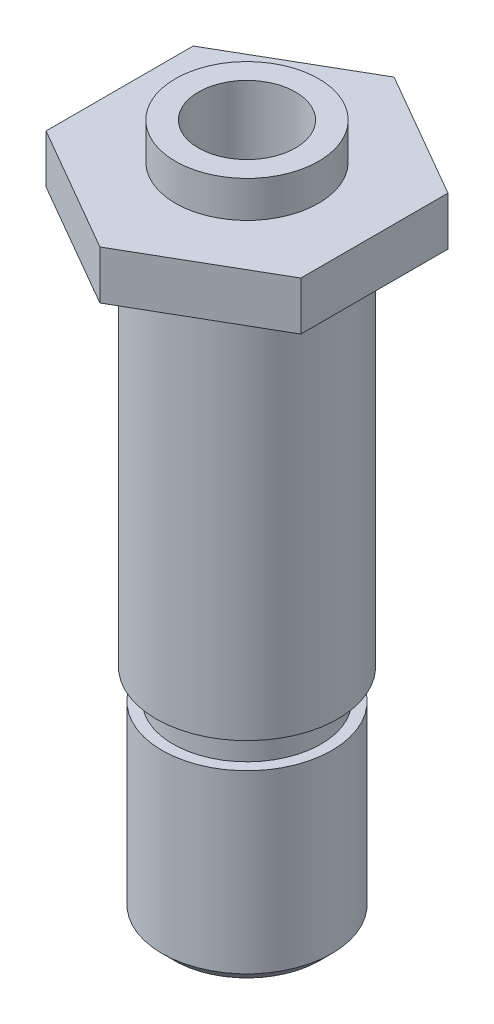
ISO-10303-21;
HEADER;
FILE_DESCRIPTION(('STEP AP214'),'2;1');
FILE_NAME('part.step','',(''),(''),'','','');
FILE_SCHEMA(('AUTOMOTIVE_DESIGN { 1 0 10303 214 1 1 1 1 }'));
ENDSEC;
DATA;
#1=APPLICATION_CONTEXT('core data for automotive mechanical design processes');
#2=APPLICATION_PROTOCOL_DEFINITION('international standard','automotive_design',2000,#1);
#3=PRODUCT_CONTEXT('',#1,'mechanical');
#4=PRODUCT('Part','Part','',(#3));
#5=PRODUCT_RELATED_PRODUCT_CATEGORY('part','',(#4));
#6=PRODUCT_DEFINITION_FORMATION('','',#4);
#7=PRODUCT_DEFINITION_CONTEXT('part definition',#1,'design');
#8=PRODUCT_DEFINITION('design','',#6,#7);
#9=PRODUCT_DEFINITION_SHAPE('','',#8);
#10=(LENGTH_UNIT() NAMED_UNIT(*) SI_UNIT(.MILLI.,.METRE.));
#11=(NAMED_UNIT(*) PLANE_ANGLE_UNIT() SI_UNIT($,.RADIAN.));
#12=(NAMED_UNIT(*) SI_UNIT($,.STERADIAN.) SOLID_ANGLE_UNIT());
#13=UNCERTAINTY_MEASURE_WITH_UNIT(LENGTH_MEASURE(1.E-05),#10,'distance_accuracy_value','');
#14=(GEOMETRIC_REPRESENTATION_CONTEXT(3) GLOBAL_UNCERTAINTY_ASSIGNED_CONTEXT((#13)) GLOBAL_UNIT_ASSIGNED_CONTEXT((#10,
#11,#12)) REPRESENTATION_CONTEXT('',''));
#15=CARTESIAN_POINT('',(0.,0.,0.));
#16=DIRECTION('',(0.,0.,1.));
#17=DIRECTION('',(1.,0.,0.));
#18=AXIS2_PLACEMENT_3D('',#15,#16,#17);
#19=CARTESIAN_POINT('',(0.,4.,12.1243556529823));
#20=DIRECTION('',(-0.5,0.,-0.866025403784439));
#21=DIRECTION('',(-0.866025403784439,0.,0.5));
#22=AXIS2_PLACEMENT_3D('',#19,#20,#21);
#23=PLANE('',#22);
#24=DIRECTION('',(0.866025403784439,0.,-0.5));
#25=VECTOR('',#24,1.);
#26=CARTESIAN_POINT('',(0.,0.,12.1243556529823));
#27=LINE('',#26,#25);
#28=CARTESIAN_POINT('',(0.,0.,12.1243556529823));
#29=VERTEX_POINT('',#28);
#30=CARTESIAN_POINT('',(10.5000000000001,0.,6.06217782649115));
#31=VERTEX_POINT('',#30);
#32=EDGE_CURVE('E120',#29,#31,#27,.T.);
#33=ORIENTED_EDGE('',*,*,#32,.T.);
#34=DIRECTION('',(0.,-1.,0.));
#35=VECTOR('',#34,1.);
#36=CARTESIAN_POINT('',(10.5000000000001,4.,6.06217782649115));
#37=LINE('',#36,#35);
#38=CARTESIAN_POINT('',(10.5000000000001,4.,6.06217782649115));
#39=VERTEX_POINT('',#38);
#40=EDGE_CURVE('E138',#39,#31,#37,.T.);
#41=ORIENTED_EDGE('',*,*,#40,.F.);
#42=DIRECTION('',(0.866025403784439,0.,-0.5));
#43=VECTOR('',#42,1.);
#44=CARTESIAN_POINT('',(0.,4.,12.1243556529823));
#45=LINE('',#44,#43);
#46=CARTESIAN_POINT('',(0.,4.,12.1243556529823));
#47=VERTEX_POINT('',#46);
#48=EDGE_CURVE('E131',#47,#39,#45,.T.);
#49=ORIENTED_EDGE('',*,*,#48,.F.);
#50=DIRECTION('',(0.,-1.,0.));
#51=VECTOR('',#50,1.);
#52=CARTESIAN_POINT('',(0.,4.,12.1243556529823));
#53=LINE('',#52,#51);
#54=EDGE_CURVE('E116',#47,#29,#53,.T.);
#55=ORIENTED_EDGE('',*,*,#54,.T.);
#56=EDGE_LOOP('',(#33,#41,#49,#55));
#57=FACE_BOUND('',#56,.T.);
#58=ADVANCED_FACE('F34',(#57),#23,.F.);
#59=CARTESIAN_POINT('',(10.5000000000001,4.,6.06217782649115));
#60=DIRECTION('',(-1.,0.,0.));
#61=DIRECTION('',(0.,0.,1.));
#62=AXIS2_PLACEMENT_3D('',#59,#60,#61);
#63=PLANE('',#62);
#64=DIRECTION('',(0.,0.,-1.));
#65=VECTOR('',#64,1.);
#66=CARTESIAN_POINT('',(10.5000000000001,0.,6.06217782649115));
#67=LINE('',#66,#65);
#68=CARTESIAN_POINT('',(10.5000000000001,0.,-6.06217782649115));
#69=VERTEX_POINT('',#68);
#70=EDGE_CURVE('E123',#31,#69,#67,.T.);
#71=ORIENTED_EDGE('',*,*,#70,.T.);
#72=DIRECTION('',(0.,-1.,0.));
#73=VECTOR('',#72,1.);
#74=CARTESIAN_POINT('',(10.5000000000001,4.,-6.06217782649115));
#75=LINE('',#74,#73);
#76=CARTESIAN_POINT('',(10.5000000000001,4.,-6.06217782649115));
#77=VERTEX_POINT('',#76);
#78=EDGE_CURVE('E135',#77,#69,#75,.T.);
#79=ORIENTED_EDGE('',*,*,#78,.F.);
#80=DIRECTION('',(0.,0.,-1.));
#81=VECTOR('',#80,1.);
#82=CARTESIAN_POINT('',(10.5000000000001,4.,6.06217782649115));
#83=LINE('',#82,#81);
#84=EDGE_CURVE('E89',#39,#77,#83,.T.);
#85=ORIENTED_EDGE('',*,*,#84,.F.);
#86=ORIENTED_EDGE('',*,*,#40,.T.);
#87=EDGE_LOOP('',(#71,#79,#85,#86));
#88=FACE_BOUND('',#87,.T.);
#89=ADVANCED_FACE('F160',(#88),#63,.F.);
#90=CARTESIAN_POINT('',(10.5000000000001,4.,-6.06217782649115));
#91=DIRECTION('',(-0.5,0.,0.866025403784439));
#92=DIRECTION('',(0.866025403784439,0.,0.5));
#93=AXIS2_PLACEMENT_3D('',#90,#91,#92);
#94=PLANE('',#93);
#95=DIRECTION('',(-0.866025403784439,0.,-0.5));
#96=VECTOR('',#95,1.);
#97=CARTESIAN_POINT('',(10.5000000000001,0.,-6.06217782649115));
#98=LINE('',#97,#96);
#99=CARTESIAN_POINT('',(0.,0.,-12.1243556529823));
#100=VERTEX_POINT('',#99);
#101=EDGE_CURVE('E126',#69,#100,#98,.T.);
#102=ORIENTED_EDGE('',*,*,#101,.T.);
#103=DIRECTION('',(0.,-1.,0.));
#104=VECTOR('',#103,1.);
#105=CARTESIAN_POINT('',(0.,4.,-12.1243556529823));
#106=LINE('',#105,#104);
#107=CARTESIAN_POINT('',(0.,4.,-12.1243556529823));
#108=VERTEX_POINT('',#107);
#109=EDGE_CURVE('E111',#108,#100,#106,.T.);
#110=ORIENTED_EDGE('',*,*,#109,.F.);
#111=DIRECTION('',(-0.866025403784439,0.,-0.5));
#112=VECTOR('',#111,1.);
#113=CARTESIAN_POINT('',(10.5000000000001,4.,-6.06217782649115));
#114=LINE('',#113,#112);
#115=EDGE_CURVE('E102',#77,#108,#114,.T.);
#116=ORIENTED_EDGE('',*,*,#115,.F.);
#117=ORIENTED_EDGE('',*,*,#78,.T.);
#118=EDGE_LOOP('',(#102,#110,#116,#117));
#119=FACE_BOUND('',#118,.T.);
#120=ADVANCED_FACE('F163',(#119),#94,.F.);
#121=CARTESIAN_POINT('',(0.,4.,-12.1243556529823));
#122=DIRECTION('',(0.5,0.,0.866025403784439));
#123=DIRECTION('',(0.866025403784439,0.,-0.5));
#124=AXIS2_PLACEMENT_3D('',#121,#122,#123);
#125=PLANE('',#124);
#126=DIRECTION('',(-0.866025403784439,0.,0.5));
#127=VECTOR('',#126,1.);
#128=CARTESIAN_POINT('',(0.,0.,-12.1243556529823));
#129=LINE('',#128,#127);
#130=CARTESIAN_POINT('',(-10.5000000000001,0.,-6.06217782649115));
#131=VERTEX_POINT('',#130);
#132=EDGE_CURVE('E110',#100,#131,#129,.T.);
#133=ORIENTED_EDGE('',*,*,#132,.T.);
#134=DIRECTION('',(0.,-1.,0.));
#135=VECTOR('',#134,1.);
#136=CARTESIAN_POINT('',(-10.5000000000001,4.,-6.06217782649115));
#137=LINE('',#136,#135);
#138=CARTESIAN_POINT('',(-10.5000000000001,4.,-6.06217782649115));
#139=VERTEX_POINT('',#138);
#140=EDGE_CURVE('E107',#139,#131,#137,.T.);
#141=ORIENTED_EDGE('',*,*,#140,.F.);
#142=DIRECTION('',(-0.866025403784439,0.,0.5));
#143=VECTOR('',#142,1.);
#144=CARTESIAN_POINT('',(0.,4.,-12.1243556529823));
#145=LINE('',#144,#143);
#146=EDGE_CURVE('E96',#108,#139,#145,.T.);
#147=ORIENTED_EDGE('',*,*,#146,.F.);
#148=ORIENTED_EDGE('',*,*,#109,.T.);
#149=EDGE_LOOP('',(#133,#141,#147,#148));
#150=FACE_BOUND('',#149,.T.);
#151=ADVANCED_FACE('F108',(#150),#125,.F.);
#152=CARTESIAN_POINT('',(-10.5000000000001,4.,-6.06217782649115));
#153=DIRECTION('',(1.,0.,0.));
#154=DIRECTION('',(0.,0.,-1.));
#155=AXIS2_PLACEMENT_3D('',#152,#153,#154);
#156=PLANE('',#155);
#157=DIRECTION('',(0.,0.,1.));
#158=VECTOR('',#157,1.);
#159=CARTESIAN_POINT('',(-10.5000000000001,0.,-6.06217782649115));
#160=LINE('',#159,#158);
#161=CARTESIAN_POINT('',(-10.5000000000001,0.,6.06217782649115));
#162=VERTEX_POINT('',#161);
#163=EDGE_CURVE('E74',#131,#162,#160,.T.);
#164=ORIENTED_EDGE('',*,*,#163,.T.);
#165=DIRECTION('',(0.,-1.,0.));
#166=VECTOR('',#165,1.);
#167=CARTESIAN_POINT('',(-10.5000000000001,4.,6.06217782649115));
#168=LINE('',#167,#166);
#169=CARTESIAN_POINT('',(-10.5000000000001,4.,6.06217782649115));
#170=VERTEX_POINT('',#169);
#171=EDGE_CURVE('E112',#170,#162,#168,.T.);
#172=ORIENTED_EDGE('',*,*,#171,.F.);
#173=DIRECTION('',(0.,0.,1.));
#174=VECTOR('',#173,1.);
#175=CARTESIAN_POINT('',(-10.5000000000001,4.,-6.06217782649115));
#176=LINE('',#175,#174);
#177=EDGE_CURVE('E100',#139,#170,#176,.T.);
#178=ORIENTED_EDGE('',*,*,#177,.F.);
#179=ORIENTED_EDGE('',*,*,#140,.T.);
#180=EDGE_LOOP('',(#164,#172,#178,#179));
#181=FACE_BOUND('',#180,.T.);
#182=ADVANCED_FACE('F114',(#181),#156,.F.);
#183=CARTESIAN_POINT('',(-10.5000000000001,4.,6.06217782649115));
#184=DIRECTION('',(0.5,0.,-0.866025403784439));
#185=DIRECTION('',(-0.866025403784439,0.,-0.5));
#186=AXIS2_PLACEMENT_3D('',#183,#184,#185);
#187=PLANE('',#186);
#188=DIRECTION('',(0.866025403784439,0.,0.5));
#189=VECTOR('',#188,1.);
#190=CARTESIAN_POINT('',(-10.5000000000001,0.,6.06217782649115));
#191=LINE('',#190,#189);
#192=EDGE_CURVE('E80',#162,#29,#191,.T.);
#193=ORIENTED_EDGE('',*,*,#192,.T.);
#194=ORIENTED_EDGE('',*,*,#54,.F.);
#195=DIRECTION('',(0.866025403784439,0.,0.5));
#196=VECTOR('',#195,1.);
#197=CARTESIAN_POINT('',(-10.5000000000001,4.,6.06217782649115));
#198=LINE('',#197,#196);
#199=EDGE_CURVE('E51',#170,#47,#198,.T.);
#200=ORIENTED_EDGE('',*,*,#199,.F.);
#201=ORIENTED_EDGE('',*,*,#171,.T.);
#202=EDGE_LOOP('',(#193,#194,#200,#201));
#203=FACE_BOUND('',#202,.T.);
#204=ADVANCED_FACE('F168',(#203),#187,.F.);
#205=CARTESIAN_POINT('',(0.,4.,0.));
#206=DIRECTION('',(0.,1.,0.));
#207=DIRECTION('',(0.,0.,1.));
#208=AXIS2_PLACEMENT_3D('',#205,#206,#207);
#209=PLANE('',#208);
#210=CARTESIAN_POINT('',(0.,4.,0.));
#211=DIRECTION('',(0.,1.,0.));
#212=DIRECTION('',(0.,0.,1.));
#213=AXIS2_PLACEMENT_3D('',#210,#211,#212);
#214=CIRCLE('',#213,5.9);
#215=CARTESIAN_POINT('',(0.,4.,5.9));
#216=VERTEX_POINT('',#215);
#217=EDGE_CURVE('E139',#216,#216,#214,.T.);
#218=ORIENTED_EDGE('',*,*,#217,.F.);
#219=EDGE_LOOP('',(#218));
#220=FACE_BOUND('',#219,.T.);
#221=ORIENTED_EDGE('',*,*,#48,.T.);
#222=ORIENTED_EDGE('',*,*,#84,.T.);
#223=ORIENTED_EDGE('',*,*,#115,.T.);
#224=ORIENTED_EDGE('',*,*,#146,.T.);
#225=ORIENTED_EDGE('',*,*,#177,.T.);
#226=ORIENTED_EDGE('',*,*,#199,.T.);
#227=EDGE_LOOP('',(#221,#222,#223,#224,#225,#226));
#228=FACE_BOUND('',#227,.T.);
#229=ADVANCED_FACE('F98',(#220,#228),#209,.T.);
#230=CARTESIAN_POINT('',(0.,0.,0.));
#231=DIRECTION('',(0.,1.,0.));
#232=DIRECTION('',(0.,0.,1.));
#233=AXIS2_PLACEMENT_3D('',#230,#231,#232);
#234=PLANE('',#233);
#235=CARTESIAN_POINT('',(0.,0.,0.));
#236=DIRECTION('',(0.,-1.,0.));
#237=DIRECTION('',(0.,0.,-1.));
#238=AXIS2_PLACEMENT_3D('',#235,#236,#237);
#239=CIRCLE('',#238,7.5);
#240=CARTESIAN_POINT('',(0.,0.,-7.5));
#241=VERTEX_POINT('',#240);
#242=EDGE_CURVE('E141',#241,#241,#239,.T.);
#243=ORIENTED_EDGE('',*,*,#242,.F.);
#244=EDGE_LOOP('',(#243));
#245=FACE_BOUND('',#244,.T.);
#246=ORIENTED_EDGE('',*,*,#32,.F.);
#247=ORIENTED_EDGE('',*,*,#192,.F.);
#248=ORIENTED_EDGE('',*,*,#163,.F.);
#249=ORIENTED_EDGE('',*,*,#132,.F.);
#250=ORIENTED_EDGE('',*,*,#101,.F.);
#251=ORIENTED_EDGE('',*,*,#70,.F.);
#252=EDGE_LOOP('',(#246,#247,#248,#249,#250,#251));
#253=FACE_BOUND('',#252,.T.);
#254=ADVANCED_FACE('F166',(#245,#253),#234,.F.);
#255=CARTESIAN_POINT('',(0.,7.,0.));
#256=DIRECTION('',(0.,-1.,0.));
#257=DIRECTION('',(0.,0.,-1.));
#258=AXIS2_PLACEMENT_3D('',#255,#256,#257);
#259=CYLINDRICAL_SURFACE('',#258,5.9);
#260=CARTESIAN_POINT('',(0.,7.,0.));
#261=DIRECTION('',(0.,1.,0.));
#262=DIRECTION('',(0.,0.,1.));
#263=AXIS2_PLACEMENT_3D('',#260,#261,#262);
#264=CIRCLE('',#263,5.9);
#265=CARTESIAN_POINT('',(0.,7.,5.9));
#266=VERTEX_POINT('',#265);
#267=EDGE_CURVE('E124',#266,#266,#264,.T.);
#268=ORIENTED_EDGE('',*,*,#267,.F.);
#269=EDGE_LOOP('',(#268));
#270=FACE_BOUND('',#269,.T.);
#271=ORIENTED_EDGE('',*,*,#217,.T.);
#272=EDGE_LOOP('',(#271));
#273=FACE_BOUND('',#272,.T.);
#274=ADVANCED_FACE('F213',(#270,#273),#259,.T.);
#275=CARTESIAN_POINT('',(0.,7.,0.));
#276=DIRECTION('',(0.,1.,0.));
#277=DIRECTION('',(0.,0.,1.));
#278=AXIS2_PLACEMENT_3D('',#275,#276,#277);
#279=PLANE('',#278);
#280=CARTESIAN_POINT('',(0.,7.,0.));
#281=DIRECTION('',(0.,1.,0.));
#282=DIRECTION('',(0.,0.,1.));
#283=AXIS2_PLACEMENT_3D('',#280,#281,#282);
#284=CIRCLE('',#283,4.);
#285=CARTESIAN_POINT('',(0.,7.,4.));
#286=VERTEX_POINT('',#285);
#287=EDGE_CURVE('E152',#286,#286,#284,.T.);
#288=ORIENTED_EDGE('',*,*,#287,.F.);
#289=EDGE_LOOP('',(#288));
#290=FACE_BOUND('',#289,.T.);
#291=ORIENTED_EDGE('',*,*,#267,.T.);
#292=EDGE_LOOP('',(#291));
#293=FACE_BOUND('',#292,.T.);
#294=ADVANCED_FACE('F218',(#290,#293),#279,.T.);
#295=CARTESIAN_POINT('',(0.,-50.,0.));
#296=DIRECTION('',(0.,1.,0.));
#297=DIRECTION('',(0.,0.,1.));
#298=AXIS2_PLACEMENT_3D('',#295,#296,#297);
#299=CYLINDRICAL_SURFACE('',#298,7.5);
#300=CARTESIAN_POINT('',(0.,-32.,0.));
#301=DIRECTION('',(0.,-1.,0.));
#302=DIRECTION('',(0.,0.,-1.));
#303=AXIS2_PLACEMENT_3D('',#300,#301,#302);
#304=CIRCLE('',#303,7.5);
#305=CARTESIAN_POINT('',(0.,-32.,-7.5));
#306=VERTEX_POINT('',#305);
#307=EDGE_CURVE('E354',#306,#306,#304,.T.);
#308=ORIENTED_EDGE('',*,*,#307,.F.);
#309=EDGE_LOOP('',(#308));
#310=FACE_BOUND('',#309,.T.);
#311=ORIENTED_EDGE('',*,*,#242,.T.);
#312=EDGE_LOOP('',(#311));
#313=FACE_BOUND('',#312,.T.);
#314=ADVANCED_FACE('F234',(#310,#313),#299,.T.);
#315=CARTESIAN_POINT('',(0.,-28.,0.));
#316=DIRECTION('',(0.,1.,0.));
#317=DIRECTION('',(0.,0.,1.));
#318=AXIS2_PLACEMENT_3D('',#315,#316,#317);
#319=CYLINDRICAL_SURFACE('',#318,4.);
#320=CARTESIAN_POINT('',(0.,-28.,0.));
#321=DIRECTION('',(0.,1.,0.));
#322=DIRECTION('',(0.,0.,1.));
#323=AXIS2_PLACEMENT_3D('',#320,#321,#322);
#324=CIRCLE('',#323,4.);
#325=CARTESIAN_POINT('',(0.,-28.,4.));
#326=VERTEX_POINT('',#325);
#327=EDGE_CURVE('E155',#326,#326,#324,.T.);
#328=ORIENTED_EDGE('',*,*,#327,.F.);
#329=EDGE_LOOP('',(#328));
#330=FACE_BOUND('',#329,.T.);
#331=ORIENTED_EDGE('',*,*,#287,.T.);
#332=EDGE_LOOP('',(#331));
#333=FACE_BOUND('',#332,.T.);
#334=ADVANCED_FACE('F242',(#330,#333),#319,.F.);
#335=CARTESIAN_POINT('',(0.,-28.,0.));
#336=DIRECTION('',(0.,1.,0.));
#337=DIRECTION('',(0.,0.,1.));
#338=AXIS2_PLACEMENT_3D('',#335,#336,#337);
#339=PLANE('',#338);
#340=CARTESIAN_POINT('',(0.,-28.,0.));
#341=DIRECTION('',(0.,1.,0.));
#342=DIRECTION('',(0.,0.,1.));
#343=AXIS2_PLACEMENT_3D('',#340,#341,#342);
#344=CIRCLE('',#343,2.);
#345=CARTESIAN_POINT('',(0.,-28.,2.));
#346=VERTEX_POINT('',#345);
#347=EDGE_CURVE('E342',#346,#346,#344,.T.);
#348=ORIENTED_EDGE('',*,*,#347,.F.);
#349=EDGE_LOOP('',(#348));
#350=FACE_BOUND('',#349,.T.);
#351=ORIENTED_EDGE('',*,*,#327,.T.);
#352=EDGE_LOOP('',(#351));
#353=FACE_BOUND('',#352,.T.);
#354=ADVANCED_FACE('F247',(#350,#353),#339,.T.);
#355=CARTESIAN_POINT('',(0.,-32.,-7.5));
#356=DIRECTION('',(0.,1.,0.));
#357=DIRECTION('',(0.,0.,1.));
#358=AXIS2_PLACEMENT_3D('',#355,#356,#357);
#359=PLANE('',#358);
#360=CARTESIAN_POINT('',(0.,-32.,0.));
#361=DIRECTION('',(0.,-1.,0.));
#362=DIRECTION('',(0.,0.,-1.));
#363=AXIS2_PLACEMENT_3D('',#360,#361,#362);
#364=CIRCLE('',#363,6.1);
#365=CARTESIAN_POINT('',(0.,-32.,-6.1));
#366=VERTEX_POINT('',#365);
#367=EDGE_CURVE('E345',#366,#366,#364,.T.);
#368=ORIENTED_EDGE('',*,*,#367,.F.);
#369=EDGE_LOOP('',(#368));
#370=FACE_BOUND('',#369,.T.);
#371=ORIENTED_EDGE('',*,*,#307,.T.);
#372=EDGE_LOOP('',(#371));
#373=FACE_BOUND('',#372,.T.);
#374=ADVANCED_FACE('F262',(#370,#373),#359,.F.);
#375=CARTESIAN_POINT('',(0.,-50.5264897013956,0.));
#376=DIRECTION('',(0.,-1.,0.));
#377=DIRECTION('',(0.,0.,-1.));
#378=AXIS2_PLACEMENT_3D('',#375,#376,#377);
#379=CYLINDRICAL_SURFACE('',#378,6.1);
#380=CARTESIAN_POINT('',(0.,-34.5,0.));
#381=DIRECTION('',(0.,-1.,0.));
#382=DIRECTION('',(0.,0.,-1.));
#383=AXIS2_PLACEMENT_3D('',#380,#381,#382);
#384=CIRCLE('',#383,6.1);
#385=CARTESIAN_POINT('',(0.,-34.5,-6.1));
#386=VERTEX_POINT('',#385);
#387=EDGE_CURVE('E341',#386,#386,#384,.T.);
#388=ORIENTED_EDGE('',*,*,#387,.F.);
#389=EDGE_LOOP('',(#388));
#390=FACE_BOUND('',#389,.T.);
#391=ORIENTED_EDGE('',*,*,#367,.T.);
#392=EDGE_LOOP('',(#391));
#393=FACE_BOUND('',#392,.T.);
#394=ADVANCED_FACE('F267',(#390,#393),#379,.T.);
#395=CARTESIAN_POINT('',(0.,-34.5,-6.1));
#396=DIRECTION('',(0.,-1.,0.));
#397=DIRECTION('',(0.,0.,-1.));
#398=AXIS2_PLACEMENT_3D('',#395,#396,#397);
#399=PLANE('',#398);
#400=CARTESIAN_POINT('',(0.,-34.5,0.));
#401=DIRECTION('',(0.,-1.,0.));
#402=DIRECTION('',(0.,0.,-1.));
#403=AXIS2_PLACEMENT_3D('',#400,#401,#402);
#404=CIRCLE('',#403,7.);
#405=CARTESIAN_POINT('',(0.,-34.5,-7.));
#406=VERTEX_POINT('',#405);
#407=EDGE_CURVE('E340',#406,#406,#404,.T.);
#408=ORIENTED_EDGE('',*,*,#407,.F.);
#409=EDGE_LOOP('',(#408));
#410=FACE_BOUND('',#409,.T.);
#411=ORIENTED_EDGE('',*,*,#387,.T.);
#412=EDGE_LOOP('',(#411));
#413=FACE_BOUND('',#412,.T.);
#414=ADVANCED_FACE('F278',(#410,#413),#399,.F.);
#415=CARTESIAN_POINT('',(0.,-50.5264897013956,0.));
#416=DIRECTION('',(0.,-1.,0.));
#417=DIRECTION('',(0.,0.,-1.));
#418=AXIS2_PLACEMENT_3D('',#415,#416,#417);
#419=CYLINDRICAL_SURFACE('',#418,7.);
#420=CARTESIAN_POINT('',(0.,-49.,0.));
#421=DIRECTION('',(0.,-1.,0.));
#422=DIRECTION('',(0.,0.,-1.));
#423=AXIS2_PLACEMENT_3D('',#420,#421,#422);
#424=CIRCLE('',#423,7.);
#425=CARTESIAN_POINT('',(0.,-49.,-7.));
#426=VERTEX_POINT('',#425);
#427=EDGE_CURVE('E11',#426,#426,#424,.F.);
#428=ORIENTED_EDGE('',*,*,#427,.T.);
#429=EDGE_LOOP('',(#428));
#430=FACE_BOUND('',#429,.T.);
#431=ORIENTED_EDGE('',*,*,#407,.T.);
#432=EDGE_LOOP('',(#431));
#433=FACE_BOUND('',#432,.T.);
#434=ADVANCED_FACE('F288',(#430,#433),#419,.T.);
#435=CARTESIAN_POINT('',(0.,-50.,0.));
#436=DIRECTION('',(0.,-1.,0.));
#437=DIRECTION('',(0.,0.,-1.));
#438=AXIS2_PLACEMENT_3D('',#435,#436,#437);
#439=PLANE('',#438);
#440=CARTESIAN_POINT('',(0.,-50.,0.));
#441=DIRECTION('',(0.,-1.,0.));
#442=DIRECTION('',(0.,0.,-1.));
#443=AXIS2_PLACEMENT_3D('',#440,#441,#442);
#444=CIRCLE('',#443,6.00000000000002);
#445=CARTESIAN_POINT('',(0.,-50.,-6.00000000000002));
#446=VERTEX_POINT('',#445);
#447=EDGE_CURVE('E43',#446,#446,#444,.T.);
#448=ORIENTED_EDGE('',*,*,#447,.T.);
#449=EDGE_LOOP('',(#448));
#450=FACE_BOUND('',#449,.T.);
#451=CARTESIAN_POINT('',(0.,-50.,0.));
#452=DIRECTION('',(0.,-1.,0.));
#453=DIRECTION('',(0.,0.,-1.));
#454=AXIS2_PLACEMENT_3D('',#451,#452,#453);
#455=CIRCLE('',#454,2.);
#456=CARTESIAN_POINT('',(0.,-50.,-2.));
#457=VERTEX_POINT('',#456);
#458=EDGE_CURVE('E348',#457,#457,#455,.T.);
#459=ORIENTED_EDGE('',*,*,#458,.F.);
#460=EDGE_LOOP('',(#459));
#461=FACE_BOUND('',#460,.T.);
#462=ADVANCED_FACE('F308',(#450,#461),#439,.T.);
#463=CARTESIAN_POINT('',(0.,7.,0.));
#464=DIRECTION('',(0.,-1.,0.));
#465=DIRECTION('',(0.,0.,-1.));
#466=AXIS2_PLACEMENT_3D('',#463,#464,#465);
#467=CYLINDRICAL_SURFACE('',#466,2.);
#468=ORIENTED_EDGE('',*,*,#347,.T.);
#469=EDGE_LOOP('',(#468));
#470=FACE_BOUND('',#469,.T.);
#471=ORIENTED_EDGE('',*,*,#458,.T.);
#472=EDGE_LOOP('',(#471));
#473=FACE_BOUND('',#472,.T.);
#474=ADVANCED_FACE('F303',(#470,#473),#467,.F.);
#475=CARTESIAN_POINT('',(0.,-50.,0.));
#476=DIRECTION('',(0.,1.,0.));
#477=DIRECTION('',(0.,0.,1.));
#478=AXIS2_PLACEMENT_3D('',#475,#476,#477);
#479=CONICAL_SURFACE('',#478,6.00000000000002,0.785398163397448);
#480=ORIENTED_EDGE('',*,*,#427,.F.);
#481=EDGE_LOOP('',(#480));
#482=FACE_BOUND('',#481,.T.);
#483=ORIENTED_EDGE('',*,*,#447,.F.);
#484=EDGE_LOOP('',(#483));
#485=FACE_BOUND('',#484,.T.);
#486=ADVANCED_FACE('F36',(#482,#485),#479,.T.);
#487=CLOSED_SHELL('',(#58,#89,#120,#151,#182,#204,#229,#254,#274,#294,#314,#334,#354,#374,#394,
#414,#434,#462,#474,#486));
#488=MANIFOLD_SOLID_BREP('B2',#487);
#489=ADVANCED_BREP_SHAPE_REPRESENTATION('',(#18,#488),#14);
#490=SHAPE_DEFINITION_REPRESENTATION(#9,#489);
ENDSEC;
END-ISO-10303-21;
